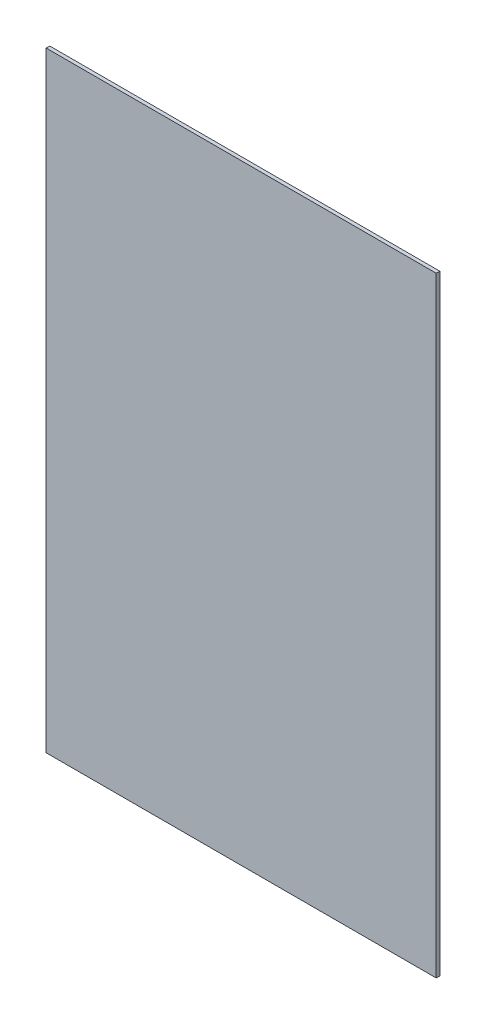
ISO-10303-21;
HEADER;
FILE_DESCRIPTION(('STEP AP214'),'2;1');
FILE_NAME('part.step','',(''),(''),'','','');
FILE_SCHEMA(('AUTOMOTIVE_DESIGN { 1 0 10303 214 1 1 1 1 }'));
ENDSEC;
DATA;
#1=APPLICATION_CONTEXT('core data for automotive mechanical design processes');
#2=APPLICATION_PROTOCOL_DEFINITION('international standard','automotive_design',2000,#1);
#3=PRODUCT_CONTEXT('',#1,'mechanical');
#4=PRODUCT('Part','Part','',(#3));
#5=PRODUCT_RELATED_PRODUCT_CATEGORY('part','',(#4));
#6=PRODUCT_DEFINITION_FORMATION('','',#4);
#7=PRODUCT_DEFINITION_CONTEXT('part definition',#1,'design');
#8=PRODUCT_DEFINITION('design','',#6,#7);
#9=PRODUCT_DEFINITION_SHAPE('','',#8);
#10=(LENGTH_UNIT() NAMED_UNIT(*) SI_UNIT(.MILLI.,.METRE.));
#11=(NAMED_UNIT(*) PLANE_ANGLE_UNIT() SI_UNIT($,.RADIAN.));
#12=(NAMED_UNIT(*) SI_UNIT($,.STERADIAN.) SOLID_ANGLE_UNIT());
#13=UNCERTAINTY_MEASURE_WITH_UNIT(LENGTH_MEASURE(1.E-05),#10,'distance_accuracy_value','');
#14=(GEOMETRIC_REPRESENTATION_CONTEXT(3) GLOBAL_UNCERTAINTY_ASSIGNED_CONTEXT((#13)) GLOBAL_UNIT_ASSIGNED_CONTEXT((#10,
#11,#12)) REPRESENTATION_CONTEXT('',''));
#15=CARTESIAN_POINT('',(0.,0.,0.));
#16=DIRECTION('',(0.,0.,1.));
#17=DIRECTION('',(1.,0.,0.));
#18=AXIS2_PLACEMENT_3D('',#15,#16,#17);
#19=CARTESIAN_POINT('',(-11493.7605719319,8062.13977970045,10.));
#20=DIRECTION('',(-1.,0.,0.));
#21=DIRECTION('',(0.,0.,1.));
#22=AXIS2_PLACEMENT_3D('',#19,#20,#21);
#23=PLANE('',#22);
#24=DIRECTION('',(0.,1.,0.));
#25=VECTOR('',#24,1.);
#26=CARTESIAN_POINT('',(-11493.7605719319,8062.13977970045,0.));
#27=LINE('',#26,#25);
#28=CARTESIAN_POINT('',(-11493.7605719319,8062.13977970045,0.));
#29=VERTEX_POINT('',#28);
#30=CARTESIAN_POINT('',(-11493.7605719319,9771.14837073355,0.));
#31=VERTEX_POINT('',#30);
#32=EDGE_CURVE('E95',#29,#31,#27,.T.);
#33=ORIENTED_EDGE('',*,*,#32,.T.);
#34=DIRECTION('',(0.,0.,-1.));
#35=VECTOR('',#34,1.);
#36=CARTESIAN_POINT('',(-11493.7605719319,9771.14837073355,10.));
#37=LINE('',#36,#35);
#38=CARTESIAN_POINT('',(-11493.7605719319,9771.14837073355,10.));
#39=VERTEX_POINT('',#38);
#40=EDGE_CURVE('E11',#39,#31,#37,.T.);
#41=ORIENTED_EDGE('',*,*,#40,.F.);
#42=DIRECTION('',(0.,1.,0.));
#43=VECTOR('',#42,1.);
#44=CARTESIAN_POINT('',(-11493.7605719319,8062.13977970045,10.));
#45=LINE('',#44,#43);
#46=CARTESIAN_POINT('',(-11493.7605719319,8062.13977970045,10.));
#47=VERTEX_POINT('',#46);
#48=EDGE_CURVE('E83',#47,#39,#45,.T.);
#49=ORIENTED_EDGE('',*,*,#48,.F.);
#50=DIRECTION('',(0.,0.,-1.));
#51=VECTOR('',#50,1.);
#52=CARTESIAN_POINT('',(-11493.7605719319,8062.13977970045,10.));
#53=LINE('',#52,#51);
#54=EDGE_CURVE('E91',#47,#29,#53,.T.);
#55=ORIENTED_EDGE('',*,*,#54,.T.);
#56=EDGE_LOOP('',(#33,#41,#49,#55));
#57=FACE_BOUND('',#56,.T.);
#58=ADVANCED_FACE('F32',(#57),#23,.F.);
#59=CARTESIAN_POINT('',(-11493.7605719319,9771.14837073355,10.));
#60=DIRECTION('',(0.,-1.,0.));
#61=DIRECTION('',(0.,0.,-1.));
#62=AXIS2_PLACEMENT_3D('',#59,#60,#61);
#63=PLANE('',#62);
#64=DIRECTION('',(-1.,0.,0.));
#65=VECTOR('',#64,1.);
#66=CARTESIAN_POINT('',(-11493.7605719319,9771.14837073355,0.));
#67=LINE('',#66,#65);
#68=CARTESIAN_POINT('',(-12585.8717769105,9771.14837073355,0.));
#69=VERTEX_POINT('',#68);
#70=EDGE_CURVE('E87',#31,#69,#67,.T.);
#71=ORIENTED_EDGE('',*,*,#70,.T.);
#72=DIRECTION('',(0.,0.,-1.));
#73=VECTOR('',#72,1.);
#74=CARTESIAN_POINT('',(-12585.8717769105,9771.14837073355,10.));
#75=LINE('',#74,#73);
#76=CARTESIAN_POINT('',(-12585.8717769105,9771.14837073355,10.));
#77=VERTEX_POINT('',#76);
#78=EDGE_CURVE('E40',#77,#69,#75,.T.);
#79=ORIENTED_EDGE('',*,*,#78,.F.);
#80=DIRECTION('',(-1.,0.,0.));
#81=VECTOR('',#80,1.);
#82=CARTESIAN_POINT('',(-11493.7605719319,9771.14837073355,10.));
#83=LINE('',#82,#81);
#84=EDGE_CURVE('E78',#39,#77,#83,.T.);
#85=ORIENTED_EDGE('',*,*,#84,.F.);
#86=ORIENTED_EDGE('',*,*,#40,.T.);
#87=EDGE_LOOP('',(#71,#79,#85,#86));
#88=FACE_BOUND('',#87,.T.);
#89=ADVANCED_FACE('F86',(#88),#63,.F.);
#90=CARTESIAN_POINT('',(-12585.8717769105,8062.13977970045,10.));
#91=DIRECTION('',(1.,0.,0.));
#92=DIRECTION('',(0.,0.,-1.));
#93=AXIS2_PLACEMENT_3D('',#90,#91,#92);
#94=PLANE('',#93);
#95=DIRECTION('',(0.,-1.,0.));
#96=VECTOR('',#95,1.);
#97=CARTESIAN_POINT('',(-12585.8717769105,8062.13977970045,0.));
#98=LINE('',#97,#96);
#99=CARTESIAN_POINT('',(-12585.8717769105,8062.13977970045,0.));
#100=VERTEX_POINT('',#99);
#101=EDGE_CURVE('E65',#69,#100,#98,.T.);
#102=ORIENTED_EDGE('',*,*,#101,.T.);
#103=DIRECTION('',(0.,0.,-1.));
#104=VECTOR('',#103,1.);
#105=CARTESIAN_POINT('',(-12585.8717769105,8062.13977970045,10.));
#106=LINE('',#105,#104);
#107=CARTESIAN_POINT('',(-12585.8717769105,8062.13977970045,10.));
#108=VERTEX_POINT('',#107);
#109=EDGE_CURVE('E88',#108,#100,#106,.T.);
#110=ORIENTED_EDGE('',*,*,#109,.F.);
#111=DIRECTION('',(0.,-1.,0.));
#112=VECTOR('',#111,1.);
#113=CARTESIAN_POINT('',(-12585.8717769105,8062.13977970045,10.));
#114=LINE('',#113,#112);
#115=EDGE_CURVE('E81',#77,#108,#114,.T.);
#116=ORIENTED_EDGE('',*,*,#115,.F.);
#117=ORIENTED_EDGE('',*,*,#78,.T.);
#118=EDGE_LOOP('',(#102,#110,#116,#117));
#119=FACE_BOUND('',#118,.T.);
#120=ADVANCED_FACE('F89',(#119),#94,.F.);
#121=CARTESIAN_POINT('',(-11493.7605719319,8062.13977970045,10.));
#122=DIRECTION('',(0.,1.,0.));
#123=DIRECTION('',(0.,0.,1.));
#124=AXIS2_PLACEMENT_3D('',#121,#122,#123);
#125=PLANE('',#124);
#126=DIRECTION('',(1.,0.,0.));
#127=VECTOR('',#126,1.);
#128=CARTESIAN_POINT('',(-11493.7605719319,8062.13977970045,0.));
#129=LINE('',#128,#127);
#130=EDGE_CURVE('E71',#100,#29,#129,.T.);
#131=ORIENTED_EDGE('',*,*,#130,.T.);
#132=ORIENTED_EDGE('',*,*,#54,.F.);
#133=DIRECTION('',(1.,0.,0.));
#134=VECTOR('',#133,1.);
#135=CARTESIAN_POINT('',(-11493.7605719319,8062.13977970045,10.));
#136=LINE('',#135,#134);
#137=EDGE_CURVE('E48',#108,#47,#136,.T.);
#138=ORIENTED_EDGE('',*,*,#137,.F.);
#139=ORIENTED_EDGE('',*,*,#109,.T.);
#140=EDGE_LOOP('',(#131,#132,#138,#139));
#141=FACE_BOUND('',#140,.T.);
#142=ADVANCED_FACE('F102',(#141),#125,.F.);
#143=CARTESIAN_POINT('',(0.,0.,10.));
#144=DIRECTION('',(0.,0.,1.));
#145=DIRECTION('',(1.,0.,0.));
#146=AXIS2_PLACEMENT_3D('',#143,#144,#145);
#147=PLANE('',#146);
#148=ORIENTED_EDGE('',*,*,#48,.T.);
#149=ORIENTED_EDGE('',*,*,#84,.T.);
#150=ORIENTED_EDGE('',*,*,#115,.T.);
#151=ORIENTED_EDGE('',*,*,#137,.T.);
#152=EDGE_LOOP('',(#148,#149,#150,#151));
#153=FACE_BOUND('',#152,.T.);
#154=ADVANCED_FACE('F79',(#153),#147,.T.);
#155=CARTESIAN_POINT('',(0.,0.,0.));
#156=DIRECTION('',(0.,0.,1.));
#157=DIRECTION('',(1.,0.,0.));
#158=AXIS2_PLACEMENT_3D('',#155,#156,#157);
#159=PLANE('',#158);
#160=ORIENTED_EDGE('',*,*,#32,.F.);
#161=ORIENTED_EDGE('',*,*,#130,.F.);
#162=ORIENTED_EDGE('',*,*,#101,.F.);
#163=ORIENTED_EDGE('',*,*,#70,.F.);
#164=EDGE_LOOP('',(#160,#161,#162,#163));
#165=FACE_BOUND('',#164,.T.);
#166=ADVANCED_FACE('F105',(#165),#159,.F.);
#167=CLOSED_SHELL('',(#58,#89,#120,#142,#154,#166));
#168=MANIFOLD_SOLID_BREP('B2',#167);
#169=ADVANCED_BREP_SHAPE_REPRESENTATION('',(#18,#168),#14);
#170=SHAPE_DEFINITION_REPRESENTATION(#9,#169);
ENDSEC;
END-ISO-10303-21;
